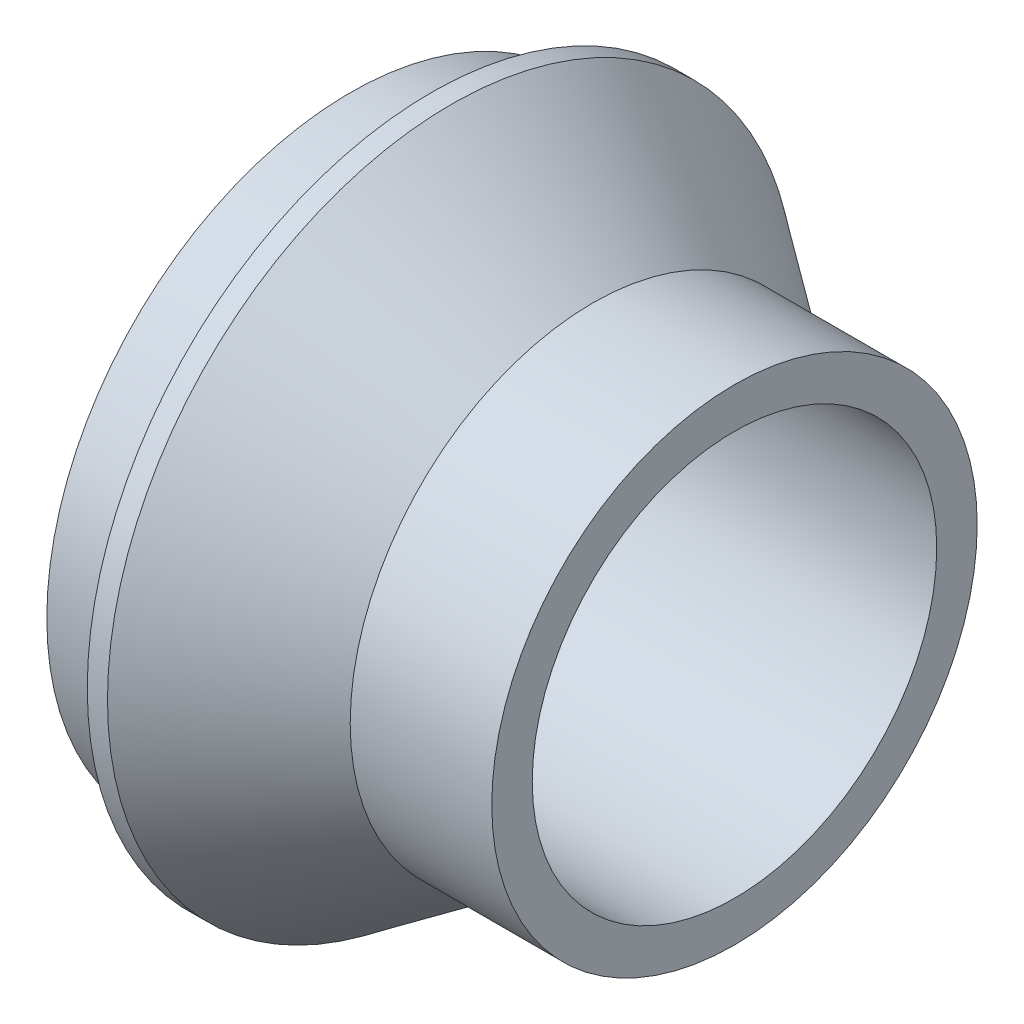
ISO-10303-21;
HEADER;
FILE_DESCRIPTION(('STEP AP214'),'2;1');
FILE_NAME('part.step','',(''),(''),'','','');
FILE_SCHEMA(('AUTOMOTIVE_DESIGN { 1 0 10303 214 1 1 1 1 }'));
ENDSEC;
DATA;
#1=APPLICATION_CONTEXT('core data for automotive mechanical design processes');
#2=APPLICATION_PROTOCOL_DEFINITION('international standard','automotive_design',2000,#1);
#3=PRODUCT_CONTEXT('',#1,'mechanical');
#4=PRODUCT('Part','Part','',(#3));
#5=PRODUCT_RELATED_PRODUCT_CATEGORY('part','',(#4));
#6=PRODUCT_DEFINITION_FORMATION('','',#4);
#7=PRODUCT_DEFINITION_CONTEXT('part definition',#1,'design');
#8=PRODUCT_DEFINITION('design','',#6,#7);
#9=PRODUCT_DEFINITION_SHAPE('','',#8);
#10=(LENGTH_UNIT() NAMED_UNIT(*) SI_UNIT(.MILLI.,.METRE.));
#11=(NAMED_UNIT(*) PLANE_ANGLE_UNIT() SI_UNIT($,.RADIAN.));
#12=(NAMED_UNIT(*) SI_UNIT($,.STERADIAN.) SOLID_ANGLE_UNIT());
#13=UNCERTAINTY_MEASURE_WITH_UNIT(LENGTH_MEASURE(1.E-05),#10,'distance_accuracy_value','');
#14=(GEOMETRIC_REPRESENTATION_CONTEXT(3) GLOBAL_UNCERTAINTY_ASSIGNED_CONTEXT((#13)) GLOBAL_UNIT_ASSIGNED_CONTEXT((#10,
#11,#12)) REPRESENTATION_CONTEXT('',''));
#15=CARTESIAN_POINT('',(0.,0.,0.));
#16=DIRECTION('',(0.,0.,1.));
#17=DIRECTION('',(1.,0.,0.));
#18=AXIS2_PLACEMENT_3D('',#15,#16,#17);
#19=CARTESIAN_POINT('',(0.,0.,0.));
#20=DIRECTION('',(-1.,0.,0.));
#21=DIRECTION('',(0.,0.,1.));
#22=AXIS2_PLACEMENT_3D('',#19,#20,#21);
#23=CYLINDRICAL_SURFACE('',#22,12.);
#24=CARTESIAN_POINT('',(12.,0.,0.));
#25=DIRECTION('',(-1.,0.,0.));
#26=DIRECTION('',(0.,0.,1.));
#27=AXIS2_PLACEMENT_3D('',#24,#25,#26);
#28=CIRCLE('',#27,12.);
#29=CARTESIAN_POINT('',(12.,0.,12.));
#30=VERTEX_POINT('',#29);
#31=EDGE_CURVE('E10',#30,#30,#28,.T.);
#32=ORIENTED_EDGE('',*,*,#31,.F.);
#33=EDGE_LOOP('',(#32));
#34=FACE_BOUND('',#33,.T.);
#35=CARTESIAN_POINT('',(19.,0.,0.));
#36=DIRECTION('',(-1.,0.,0.));
#37=DIRECTION('',(0.,0.,1.));
#38=AXIS2_PLACEMENT_3D('',#35,#36,#37);
#39=CIRCLE('',#38,12.);
#40=CARTESIAN_POINT('',(19.,0.,12.));
#41=VERTEX_POINT('',#40);
#42=EDGE_CURVE('E67',#41,#41,#39,.T.);
#43=ORIENTED_EDGE('',*,*,#42,.T.);
#44=EDGE_LOOP('',(#43));
#45=FACE_BOUND('',#44,.T.);
#46=ADVANCED_FACE('F33',(#34,#45),#23,.T.);
#47=CARTESIAN_POINT('',(12.,0.,0.));
#48=DIRECTION('',(-1.,0.,0.));
#49=DIRECTION('',(0.,0.,1.));
#50=AXIS2_PLACEMENT_3D('',#47,#48,#49);
#51=CONICAL_SURFACE('',#50,12.,0.620249485982821);
#52=CARTESIAN_POINT('',(5.,0.,0.));
#53=DIRECTION('',(-1.,0.,0.));
#54=DIRECTION('',(0.,0.,1.));
#55=AXIS2_PLACEMENT_3D('',#52,#53,#54);
#56=CIRCLE('',#55,17.);
#57=CARTESIAN_POINT('',(5.,0.,17.));
#58=VERTEX_POINT('',#57);
#59=EDGE_CURVE('E39',#58,#58,#56,.T.);
#60=ORIENTED_EDGE('',*,*,#59,.F.);
#61=EDGE_LOOP('',(#60));
#62=FACE_BOUND('',#61,.T.);
#63=ORIENTED_EDGE('',*,*,#31,.T.);
#64=EDGE_LOOP('',(#63));
#65=FACE_BOUND('',#64,.T.);
#66=ADVANCED_FACE('F114',(#62,#65),#51,.T.);
#67=CARTESIAN_POINT('',(0.,0.,0.));
#68=DIRECTION('',(-1.,0.,0.));
#69=DIRECTION('',(0.,0.,1.));
#70=AXIS2_PLACEMENT_3D('',#67,#68,#69);
#71=CYLINDRICAL_SURFACE('',#70,17.);
#72=CARTESIAN_POINT('',(4.,0.,0.));
#73=DIRECTION('',(-1.,0.,0.));
#74=DIRECTION('',(0.,0.,1.));
#75=AXIS2_PLACEMENT_3D('',#72,#73,#74);
#76=CIRCLE('',#75,17.);
#77=CARTESIAN_POINT('',(4.,0.,17.));
#78=VERTEX_POINT('',#77);
#79=EDGE_CURVE('E43',#78,#78,#76,.T.);
#80=ORIENTED_EDGE('',*,*,#79,.F.);
#81=EDGE_LOOP('',(#80));
#82=FACE_BOUND('',#81,.T.);
#83=ORIENTED_EDGE('',*,*,#59,.T.);
#84=EDGE_LOOP('',(#83));
#85=FACE_BOUND('',#84,.T.);
#86=ADVANCED_FACE('F110',(#82,#85),#71,.T.);
#87=CARTESIAN_POINT('',(4.,0.,0.));
#88=DIRECTION('',(-1.,0.,0.));
#89=DIRECTION('',(0.,0.,1.));
#90=AXIS2_PLACEMENT_3D('',#87,#88,#89);
#91=PLANE('',#90);
#92=ORIENTED_EDGE('',*,*,#79,.T.);
#93=EDGE_LOOP('',(#92));
#94=FACE_BOUND('',#93,.T.);
#95=CARTESIAN_POINT('',(4.,0.,0.));
#96=DIRECTION('',(-1.,0.,0.));
#97=DIRECTION('',(0.,0.,1.));
#98=AXIS2_PLACEMENT_3D('',#95,#96,#97);
#99=CIRCLE('',#98,15.);
#100=CARTESIAN_POINT('',(4.,0.,15.));
#101=VERTEX_POINT('',#100);
#102=EDGE_CURVE('E47',#101,#101,#99,.T.);
#103=ORIENTED_EDGE('',*,*,#102,.F.);
#104=EDGE_LOOP('',(#103));
#105=FACE_BOUND('',#104,.T.);
#106=ADVANCED_FACE('F104',(#94,#105),#91,.T.);
#107=CARTESIAN_POINT('',(0.,0.,0.));
#108=DIRECTION('',(-1.,0.,0.));
#109=DIRECTION('',(0.,0.,1.));
#110=AXIS2_PLACEMENT_3D('',#107,#108,#109);
#111=CYLINDRICAL_SURFACE('',#110,15.);
#112=ORIENTED_EDGE('',*,*,#102,.T.);
#113=EDGE_LOOP('',(#112));
#114=FACE_BOUND('',#113,.T.);
#115=CARTESIAN_POINT('',(0.,0.,0.));
#116=DIRECTION('',(-1.,0.,0.));
#117=DIRECTION('',(0.,0.,1.));
#118=AXIS2_PLACEMENT_3D('',#115,#116,#117);
#119=CIRCLE('',#118,15.);
#120=CARTESIAN_POINT('',(0.,0.,15.));
#121=VERTEX_POINT('',#120);
#122=EDGE_CURVE('E52',#121,#121,#119,.T.);
#123=ORIENTED_EDGE('',*,*,#122,.F.);
#124=EDGE_LOOP('',(#123));
#125=FACE_BOUND('',#124,.T.);
#126=ADVANCED_FACE('F99',(#114,#125),#111,.T.);
#127=CARTESIAN_POINT('',(0.,0.,0.));
#128=DIRECTION('',(1.,0.,0.));
#129=DIRECTION('',(0.,0.,-1.));
#130=AXIS2_PLACEMENT_3D('',#127,#128,#129);
#131=PLANE('',#130);
#132=CARTESIAN_POINT('',(0.,0.,0.));
#133=DIRECTION('',(-1.,0.,0.));
#134=DIRECTION('',(0.,0.,1.));
#135=AXIS2_PLACEMENT_3D('',#132,#133,#134);
#136=CIRCLE('',#135,13.);
#137=CARTESIAN_POINT('',(0.,0.,13.));
#138=VERTEX_POINT('',#137);
#139=EDGE_CURVE('E55',#138,#138,#136,.T.);
#140=ORIENTED_EDGE('',*,*,#139,.F.);
#141=EDGE_LOOP('',(#140));
#142=FACE_BOUND('',#141,.T.);
#143=ORIENTED_EDGE('',*,*,#122,.T.);
#144=EDGE_LOOP('',(#143));
#145=FACE_BOUND('',#144,.T.);
#146=ADVANCED_FACE('F93',(#142,#145),#131,.F.);
#147=CARTESIAN_POINT('',(0.,0.,0.));
#148=DIRECTION('',(-1.,0.,0.));
#149=DIRECTION('',(0.,0.,1.));
#150=AXIS2_PLACEMENT_3D('',#147,#148,#149);
#151=CYLINDRICAL_SURFACE('',#150,13.);
#152=CARTESIAN_POINT('',(4.,0.,0.));
#153=DIRECTION('',(-1.,0.,0.));
#154=DIRECTION('',(0.,0.,1.));
#155=AXIS2_PLACEMENT_3D('',#152,#153,#154);
#156=CIRCLE('',#155,13.);
#157=CARTESIAN_POINT('',(4.,0.,13.));
#158=VERTEX_POINT('',#157);
#159=EDGE_CURVE('E58',#158,#158,#156,.T.);
#160=ORIENTED_EDGE('',*,*,#159,.F.);
#161=EDGE_LOOP('',(#160));
#162=FACE_BOUND('',#161,.T.);
#163=ORIENTED_EDGE('',*,*,#139,.T.);
#164=EDGE_LOOP('',(#163));
#165=FACE_BOUND('',#164,.T.);
#166=ADVANCED_FACE('F87',(#162,#165),#151,.F.);
#167=CARTESIAN_POINT('',(4.,0.,0.));
#168=DIRECTION('',(1.,0.,0.));
#169=DIRECTION('',(0.,0.,-1.));
#170=AXIS2_PLACEMENT_3D('',#167,#168,#169);
#171=PLANE('',#170);
#172=CARTESIAN_POINT('',(4.,0.,0.));
#173=DIRECTION('',(-1.,0.,0.));
#174=DIRECTION('',(0.,0.,1.));
#175=AXIS2_PLACEMENT_3D('',#172,#173,#174);
#176=CIRCLE('',#175,10.);
#177=CARTESIAN_POINT('',(4.,0.,10.));
#178=VERTEX_POINT('',#177);
#179=EDGE_CURVE('E61',#178,#178,#176,.T.);
#180=ORIENTED_EDGE('',*,*,#179,.F.);
#181=EDGE_LOOP('',(#180));
#182=FACE_BOUND('',#181,.T.);
#183=ORIENTED_EDGE('',*,*,#159,.T.);
#184=EDGE_LOOP('',(#183));
#185=FACE_BOUND('',#184,.T.);
#186=ADVANCED_FACE('F81',(#182,#185),#171,.F.);
#187=CARTESIAN_POINT('',(0.,0.,0.));
#188=DIRECTION('',(-1.,0.,0.));
#189=DIRECTION('',(0.,0.,1.));
#190=AXIS2_PLACEMENT_3D('',#187,#188,#189);
#191=CYLINDRICAL_SURFACE('',#190,10.);
#192=CARTESIAN_POINT('',(19.,0.,0.));
#193=DIRECTION('',(-1.,0.,0.));
#194=DIRECTION('',(0.,0.,1.));
#195=AXIS2_PLACEMENT_3D('',#192,#193,#194);
#196=CIRCLE('',#195,10.);
#197=CARTESIAN_POINT('',(19.,0.,10.));
#198=VERTEX_POINT('',#197);
#199=EDGE_CURVE('E64',#198,#198,#196,.T.);
#200=ORIENTED_EDGE('',*,*,#199,.F.);
#201=EDGE_LOOP('',(#200));
#202=FACE_BOUND('',#201,.T.);
#203=ORIENTED_EDGE('',*,*,#179,.T.);
#204=EDGE_LOOP('',(#203));
#205=FACE_BOUND('',#204,.T.);
#206=ADVANCED_FACE('F75',(#202,#205),#191,.F.);
#207=CARTESIAN_POINT('',(19.,0.,0.));
#208=DIRECTION('',(-1.,0.,0.));
#209=DIRECTION('',(0.,0.,1.));
#210=AXIS2_PLACEMENT_3D('',#207,#208,#209);
#211=PLANE('',#210);
#212=ORIENTED_EDGE('',*,*,#42,.F.);
#213=EDGE_LOOP('',(#212));
#214=FACE_BOUND('',#213,.T.);
#215=ORIENTED_EDGE('',*,*,#199,.T.);
#216=EDGE_LOOP('',(#215));
#217=FACE_BOUND('',#216,.T.);
#218=ADVANCED_FACE('F72',(#214,#217),#211,.F.);
#219=CLOSED_SHELL('',(#46,#66,#86,#106,#126,#146,#166,#186,#206,#218));
#220=MANIFOLD_SOLID_BREP('B2',#219);
#221=ADVANCED_BREP_SHAPE_REPRESENTATION('',(#18,#220),#14);
#222=SHAPE_DEFINITION_REPRESENTATION(#9,#221);
ENDSEC;
END-ISO-10303-21;
